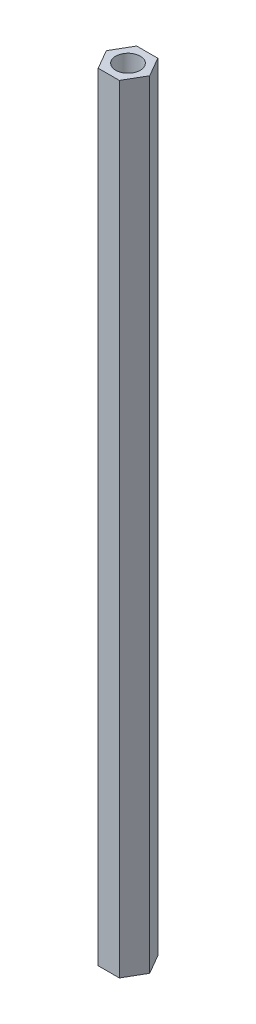
ISO-10303-21;
HEADER;
FILE_DESCRIPTION(('STEP AP214'),'2;1');
FILE_NAME('part.step','',(''),(''),'','','');
FILE_SCHEMA(('AUTOMOTIVE_DESIGN { 1 0 10303 214 1 1 1 1 }'));
ENDSEC;
DATA;
#1=APPLICATION_CONTEXT('core data for automotive mechanical design processes');
#2=APPLICATION_PROTOCOL_DEFINITION('international standard','automotive_design',2000,#1);
#3=PRODUCT_CONTEXT('',#1,'mechanical');
#4=PRODUCT('Part','Part','',(#3));
#5=PRODUCT_RELATED_PRODUCT_CATEGORY('part','',(#4));
#6=PRODUCT_DEFINITION_FORMATION('','',#4);
#7=PRODUCT_DEFINITION_CONTEXT('part definition',#1,'design');
#8=PRODUCT_DEFINITION('design','',#6,#7);
#9=PRODUCT_DEFINITION_SHAPE('','',#8);
#10=(LENGTH_UNIT() NAMED_UNIT(*) SI_UNIT(.MILLI.,.METRE.));
#11=(NAMED_UNIT(*) PLANE_ANGLE_UNIT() SI_UNIT($,.RADIAN.));
#12=(NAMED_UNIT(*) SI_UNIT($,.STERADIAN.) SOLID_ANGLE_UNIT());
#13=UNCERTAINTY_MEASURE_WITH_UNIT(LENGTH_MEASURE(1.E-05),#10,'distance_accuracy_value','');
#14=(GEOMETRIC_REPRESENTATION_CONTEXT(3) GLOBAL_UNCERTAINTY_ASSIGNED_CONTEXT((#13)) GLOBAL_UNIT_ASSIGNED_CONTEXT((#10,
#11,#12)) REPRESENTATION_CONTEXT('',''));
#15=CARTESIAN_POINT('',(0.,0.,0.));
#16=DIRECTION('',(0.,0.,1.));
#17=DIRECTION('',(1.,0.,0.));
#18=AXIS2_PLACEMENT_3D('',#15,#16,#17);
#19=CARTESIAN_POINT('',(0.,95.,0.));
#20=DIRECTION('',(0.,1.,0.));
#21=DIRECTION('',(0.,0.,1.));
#22=AXIS2_PLACEMENT_3D('',#19,#20,#21);
#23=PLANE('',#22);
#24=DIRECTION('',(0.499999999999998,0.,0.86602540378444));
#25=VECTOR('',#24,1.);
#26=CARTESIAN_POINT('',(-1.29322686740439,95.,2.35));
#27=LINE('',#26,#25);
#28=CARTESIAN_POINT('',(-2.65,95.,0.));
#29=VERTEX_POINT('',#28);
#30=CARTESIAN_POINT('',(-1.29322686740439,95.,2.35));
#31=VERTEX_POINT('',#30);
#32=EDGE_CURVE('E146',#29,#31,#27,.T.);
#33=ORIENTED_EDGE('',*,*,#32,.T.);
#34=DIRECTION('',(1.,0.,0.));
#35=VECTOR('',#34,1.);
#36=CARTESIAN_POINT('',(1.29322686740439,95.,2.35));
#37=LINE('',#36,#35);
#38=CARTESIAN_POINT('',(1.29322686740439,95.,2.35));
#39=VERTEX_POINT('',#38);
#40=EDGE_CURVE('E94',#31,#39,#37,.T.);
#41=ORIENTED_EDGE('',*,*,#40,.T.);
#42=DIRECTION('',(0.499999999999998,0.,-0.86602540378444));
#43=VECTOR('',#42,1.);
#44=CARTESIAN_POINT('',(1.29322686740439,95.,2.35));
#45=LINE('',#44,#43);
#46=CARTESIAN_POINT('',(2.65,95.,0.));
#47=VERTEX_POINT('',#46);
#48=EDGE_CURVE('E107',#39,#47,#45,.T.);
#49=ORIENTED_EDGE('',*,*,#48,.T.);
#50=DIRECTION('',(-0.499999999999998,0.,-0.86602540378444));
#51=VECTOR('',#50,1.);
#52=CARTESIAN_POINT('',(1.29322686740439,95.,-2.35));
#53=LINE('',#52,#51);
#54=CARTESIAN_POINT('',(1.29322686740439,95.,-2.35));
#55=VERTEX_POINT('',#54);
#56=EDGE_CURVE('E101',#47,#55,#53,.T.);
#57=ORIENTED_EDGE('',*,*,#56,.T.);
#58=DIRECTION('',(-1.,0.,0.));
#59=VECTOR('',#58,1.);
#60=CARTESIAN_POINT('',(1.29322686740439,95.,-2.35));
#61=LINE('',#60,#59);
#62=CARTESIAN_POINT('',(-1.29322686740439,95.,-2.35));
#63=VERTEX_POINT('',#62);
#64=EDGE_CURVE('E105',#55,#63,#61,.T.);
#65=ORIENTED_EDGE('',*,*,#64,.T.);
#66=DIRECTION('',(-0.499999999999998,0.,0.86602540378444));
#67=VECTOR('',#66,1.);
#68=CARTESIAN_POINT('',(-1.29322686740439,95.,-2.35));
#69=LINE('',#68,#67);
#70=EDGE_CURVE('E57',#63,#29,#69,.T.);
#71=ORIENTED_EDGE('',*,*,#70,.T.);
#72=EDGE_LOOP('',(#33,#41,#49,#57,#65,#71));
#73=FACE_BOUND('',#72,.T.);
#74=CARTESIAN_POINT('',(0.,95.,0.));
#75=DIRECTION('',(0.,1.,0.));
#76=DIRECTION('',(0.,0.,1.));
#77=AXIS2_PLACEMENT_3D('',#74,#75,#76);
#78=CIRCLE('',#77,1.5);
#79=CARTESIAN_POINT('',(0.,95.,1.5));
#80=VERTEX_POINT('',#79);
#81=EDGE_CURVE('E134',#80,#80,#78,.T.);
#82=ORIENTED_EDGE('',*,*,#81,.F.);
#83=EDGE_LOOP('',(#82));
#84=FACE_BOUND('',#83,.T.);
#85=ADVANCED_FACE('F39',(#73,#84),#23,.T.);
#86=CARTESIAN_POINT('',(0.,0.,0.));
#87=DIRECTION('',(0.,1.,0.));
#88=DIRECTION('',(0.,0.,1.));
#89=AXIS2_PLACEMENT_3D('',#86,#87,#88);
#90=PLANE('',#89);
#91=DIRECTION('',(0.499999999999998,0.,0.86602540378444));
#92=VECTOR('',#91,1.);
#93=CARTESIAN_POINT('',(-1.29322686740439,0.,2.35));
#94=LINE('',#93,#92);
#95=CARTESIAN_POINT('',(-2.65,0.,0.));
#96=VERTEX_POINT('',#95);
#97=CARTESIAN_POINT('',(-1.29322686740439,0.,2.35));
#98=VERTEX_POINT('',#97);
#99=EDGE_CURVE('E129',#96,#98,#94,.T.);
#100=ORIENTED_EDGE('',*,*,#99,.F.);
#101=DIRECTION('',(-0.499999999999998,0.,0.86602540378444));
#102=VECTOR('',#101,1.);
#103=CARTESIAN_POINT('',(-1.29322686740439,0.,-2.35));
#104=LINE('',#103,#102);
#105=CARTESIAN_POINT('',(-1.29322686740439,0.,-2.35));
#106=VERTEX_POINT('',#105);
#107=EDGE_CURVE('E86',#106,#96,#104,.T.);
#108=ORIENTED_EDGE('',*,*,#107,.F.);
#109=DIRECTION('',(-1.,0.,0.));
#110=VECTOR('',#109,1.);
#111=CARTESIAN_POINT('',(1.29322686740439,0.,-2.35));
#112=LINE('',#111,#110);
#113=CARTESIAN_POINT('',(1.29322686740439,0.,-2.35));
#114=VERTEX_POINT('',#113);
#115=EDGE_CURVE('E80',#114,#106,#112,.T.);
#116=ORIENTED_EDGE('',*,*,#115,.F.);
#117=DIRECTION('',(-0.499999999999998,0.,-0.86602540378444));
#118=VECTOR('',#117,1.);
#119=CARTESIAN_POINT('',(1.29322686740439,0.,-2.35));
#120=LINE('',#119,#118);
#121=CARTESIAN_POINT('',(2.65,0.,0.));
#122=VERTEX_POINT('',#121);
#123=EDGE_CURVE('E116',#122,#114,#120,.T.);
#124=ORIENTED_EDGE('',*,*,#123,.F.);
#125=DIRECTION('',(0.499999999999998,0.,-0.86602540378444));
#126=VECTOR('',#125,1.);
#127=CARTESIAN_POINT('',(1.29322686740439,0.,2.35));
#128=LINE('',#127,#126);
#129=CARTESIAN_POINT('',(1.29322686740439,0.,2.35));
#130=VERTEX_POINT('',#129);
#131=EDGE_CURVE('E137',#130,#122,#128,.T.);
#132=ORIENTED_EDGE('',*,*,#131,.F.);
#133=DIRECTION('',(1.,0.,0.));
#134=VECTOR('',#133,1.);
#135=CARTESIAN_POINT('',(1.29322686740439,0.,2.35));
#136=LINE('',#135,#134);
#137=EDGE_CURVE('E133',#98,#130,#136,.T.);
#138=ORIENTED_EDGE('',*,*,#137,.F.);
#139=EDGE_LOOP('',(#100,#108,#116,#124,#132,#138));
#140=FACE_BOUND('',#139,.T.);
#141=CARTESIAN_POINT('',(0.,0.,0.));
#142=DIRECTION('',(0.,1.,0.));
#143=DIRECTION('',(0.,0.,1.));
#144=AXIS2_PLACEMENT_3D('',#141,#142,#143);
#145=CIRCLE('',#144,1.5);
#146=CARTESIAN_POINT('',(0.,0.,1.5));
#147=VERTEX_POINT('',#146);
#148=EDGE_CURVE('E243',#147,#147,#145,.T.);
#149=ORIENTED_EDGE('',*,*,#148,.T.);
#150=EDGE_LOOP('',(#149));
#151=FACE_BOUND('',#150,.T.);
#152=ADVANCED_FACE('F159',(#140,#151),#90,.F.);
#153=CARTESIAN_POINT('',(-1.29322686740439,95.,2.35));
#154=DIRECTION('',(0.86602540378444,0.,-0.499999999999998));
#155=DIRECTION('',(-0.499999999999998,0.,-0.86602540378444));
#156=AXIS2_PLACEMENT_3D('',#153,#154,#155);
#157=PLANE('',#156);
#158=ORIENTED_EDGE('',*,*,#99,.T.);
#159=DIRECTION('',(0.,-1.,0.));
#160=VECTOR('',#159,1.);
#161=CARTESIAN_POINT('',(-1.29322686740439,95.,2.35));
#162=LINE('',#161,#160);
#163=EDGE_CURVE('E11',#31,#98,#162,.T.);
#164=ORIENTED_EDGE('',*,*,#163,.F.);
#165=ORIENTED_EDGE('',*,*,#32,.F.);
#166=DIRECTION('',(0.,-1.,0.));
#167=VECTOR('',#166,1.);
#168=CARTESIAN_POINT('',(-2.65,95.,0.));
#169=LINE('',#168,#167);
#170=EDGE_CURVE('E125',#29,#96,#169,.T.);
#171=ORIENTED_EDGE('',*,*,#170,.T.);
#172=EDGE_LOOP('',(#158,#164,#165,#171));
#173=FACE_BOUND('',#172,.T.);
#174=ADVANCED_FACE('F41',(#173),#157,.F.);
#175=CARTESIAN_POINT('',(1.29322686740439,95.,2.35));
#176=DIRECTION('',(0.,0.,-1.));
#177=DIRECTION('',(-1.,0.,0.));
#178=AXIS2_PLACEMENT_3D('',#175,#176,#177);
#179=PLANE('',#178);
#180=ORIENTED_EDGE('',*,*,#137,.T.);
#181=DIRECTION('',(0.,-1.,0.));
#182=VECTOR('',#181,1.);
#183=CARTESIAN_POINT('',(1.29322686740439,95.,2.35));
#184=LINE('',#183,#182);
#185=EDGE_CURVE('E49',#39,#130,#184,.T.);
#186=ORIENTED_EDGE('',*,*,#185,.F.);
#187=ORIENTED_EDGE('',*,*,#40,.F.);
#188=ORIENTED_EDGE('',*,*,#163,.T.);
#189=EDGE_LOOP('',(#180,#186,#187,#188));
#190=FACE_BOUND('',#189,.T.);
#191=ADVANCED_FACE('F184',(#190),#179,.F.);
#192=CARTESIAN_POINT('',(1.29322686740439,95.,2.35));
#193=DIRECTION('',(-0.86602540378444,0.,-0.499999999999998));
#194=DIRECTION('',(-0.499999999999998,0.,0.86602540378444));
#195=AXIS2_PLACEMENT_3D('',#192,#193,#194);
#196=PLANE('',#195);
#197=ORIENTED_EDGE('',*,*,#131,.T.);
#198=DIRECTION('',(0.,-1.,0.));
#199=VECTOR('',#198,1.);
#200=CARTESIAN_POINT('',(2.65,95.,0.));
#201=LINE('',#200,#199);
#202=EDGE_CURVE('E118',#47,#122,#201,.T.);
#203=ORIENTED_EDGE('',*,*,#202,.F.);
#204=ORIENTED_EDGE('',*,*,#48,.F.);
#205=ORIENTED_EDGE('',*,*,#185,.T.);
#206=EDGE_LOOP('',(#197,#203,#204,#205));
#207=FACE_BOUND('',#206,.T.);
#208=ADVANCED_FACE('F156',(#207),#196,.F.);
#209=CARTESIAN_POINT('',(1.29322686740439,95.,-2.35));
#210=DIRECTION('',(-0.86602540378444,0.,0.499999999999998));
#211=DIRECTION('',(0.499999999999998,0.,0.86602540378444));
#212=AXIS2_PLACEMENT_3D('',#209,#210,#211);
#213=PLANE('',#212);
#214=ORIENTED_EDGE('',*,*,#123,.T.);
#215=DIRECTION('',(0.,-1.,0.));
#216=VECTOR('',#215,1.);
#217=CARTESIAN_POINT('',(1.29322686740439,95.,-2.35));
#218=LINE('',#217,#216);
#219=EDGE_CURVE('E113',#55,#114,#218,.T.);
#220=ORIENTED_EDGE('',*,*,#219,.F.);
#221=ORIENTED_EDGE('',*,*,#56,.F.);
#222=ORIENTED_EDGE('',*,*,#202,.T.);
#223=EDGE_LOOP('',(#214,#220,#221,#222));
#224=FACE_BOUND('',#223,.T.);
#225=ADVANCED_FACE('F114',(#224),#213,.F.);
#226=CARTESIAN_POINT('',(1.29322686740439,95.,-2.35));
#227=DIRECTION('',(0.,0.,1.));
#228=DIRECTION('',(1.,0.,0.));
#229=AXIS2_PLACEMENT_3D('',#226,#227,#228);
#230=PLANE('',#229);
#231=ORIENTED_EDGE('',*,*,#115,.T.);
#232=DIRECTION('',(0.,-1.,0.));
#233=VECTOR('',#232,1.);
#234=CARTESIAN_POINT('',(-1.29322686740439,95.,-2.35));
#235=LINE('',#234,#233);
#236=EDGE_CURVE('E119',#63,#106,#235,.T.);
#237=ORIENTED_EDGE('',*,*,#236,.F.);
#238=ORIENTED_EDGE('',*,*,#64,.F.);
#239=ORIENTED_EDGE('',*,*,#219,.T.);
#240=EDGE_LOOP('',(#231,#237,#238,#239));
#241=FACE_BOUND('',#240,.T.);
#242=ADVANCED_FACE('F121',(#241),#230,.F.);
#243=CARTESIAN_POINT('',(-1.29322686740439,95.,-2.35));
#244=DIRECTION('',(0.86602540378444,0.,0.499999999999998));
#245=DIRECTION('',(0.499999999999998,0.,-0.86602540378444));
#246=AXIS2_PLACEMENT_3D('',#243,#244,#245);
#247=PLANE('',#246);
#248=ORIENTED_EDGE('',*,*,#107,.T.);
#249=ORIENTED_EDGE('',*,*,#170,.F.);
#250=ORIENTED_EDGE('',*,*,#70,.F.);
#251=ORIENTED_EDGE('',*,*,#236,.T.);
#252=EDGE_LOOP('',(#248,#249,#250,#251));
#253=FACE_BOUND('',#252,.T.);
#254=ADVANCED_FACE('F164',(#253),#247,.F.);
#255=CARTESIAN_POINT('',(0.,95.,0.));
#256=DIRECTION('',(0.,-1.,0.));
#257=DIRECTION('',(0.,0.,-1.));
#258=AXIS2_PLACEMENT_3D('',#255,#256,#257);
#259=CYLINDRICAL_SURFACE('',#258,1.5);
#260=ORIENTED_EDGE('',*,*,#81,.T.);
#261=EDGE_LOOP('',(#260));
#262=FACE_BOUND('',#261,.T.);
#263=ORIENTED_EDGE('',*,*,#148,.F.);
#264=EDGE_LOOP('',(#263));
#265=FACE_BOUND('',#264,.T.);
#266=ADVANCED_FACE('F166',(#262,#265),#259,.F.);
#267=CLOSED_SHELL('',(#85,#152,#174,#191,#208,#225,#242,#254,#266));
#268=MANIFOLD_SOLID_BREP('B2',#267);
#269=ADVANCED_BREP_SHAPE_REPRESENTATION('',(#18,#268),#14);
#270=SHAPE_DEFINITION_REPRESENTATION(#9,#269);
ENDSEC;
END-ISO-10303-21;
